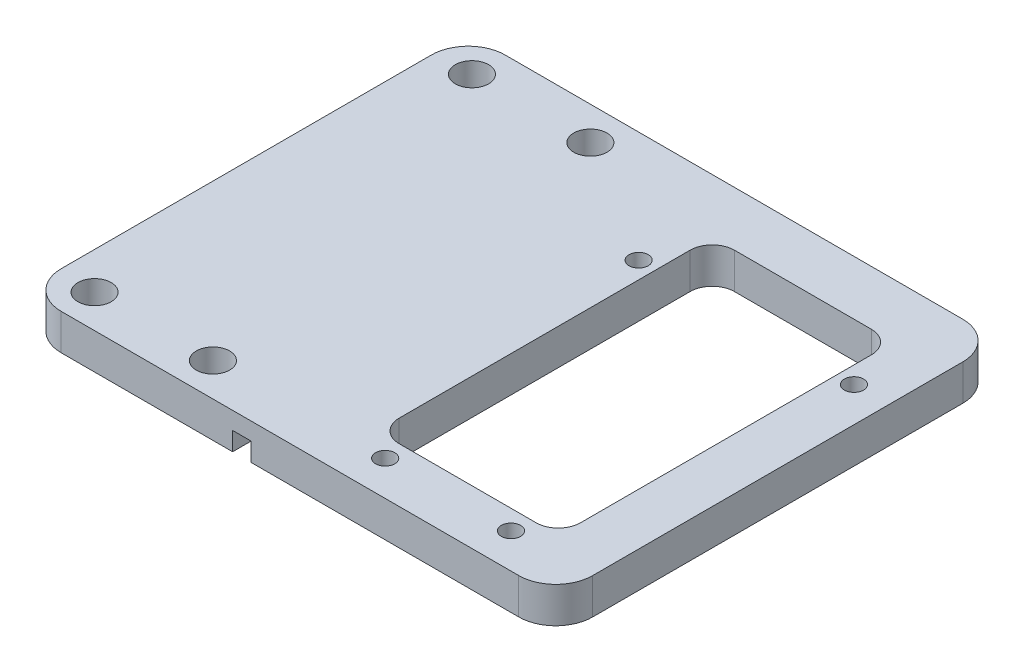
ISO-10303-21;
HEADER;
FILE_DESCRIPTION(('STEP AP214'),'2;1');
FILE_NAME('part.step','',(''),(''),'','','');
FILE_SCHEMA(('AUTOMOTIVE_DESIGN { 1 0 10303 214 1 1 1 1 }'));
ENDSEC;
DATA;
#1=APPLICATION_CONTEXT('core data for automotive mechanical design processes');
#2=APPLICATION_PROTOCOL_DEFINITION('international standard','automotive_design',2000,#1);
#3=PRODUCT_CONTEXT('',#1,'mechanical');
#4=PRODUCT('Part','Part','',(#3));
#5=PRODUCT_RELATED_PRODUCT_CATEGORY('part','',(#4));
#6=PRODUCT_DEFINITION_FORMATION('','',#4);
#7=PRODUCT_DEFINITION_CONTEXT('part definition',#1,'design');
#8=PRODUCT_DEFINITION('design','',#6,#7);
#9=PRODUCT_DEFINITION_SHAPE('','',#8);
#10=(LENGTH_UNIT() NAMED_UNIT(*) SI_UNIT(.MILLI.,.METRE.));
#11=(NAMED_UNIT(*) PLANE_ANGLE_UNIT() SI_UNIT($,.RADIAN.));
#12=(NAMED_UNIT(*) SI_UNIT($,.STERADIAN.) SOLID_ANGLE_UNIT());
#13=UNCERTAINTY_MEASURE_WITH_UNIT(LENGTH_MEASURE(1.E-05),#10,'distance_accuracy_value','');
#14=(GEOMETRIC_REPRESENTATION_CONTEXT(3) GLOBAL_UNCERTAINTY_ASSIGNED_CONTEXT((#13)) GLOBAL_UNIT_ASSIGNED_CONTEXT((#10,
#11,#12)) REPRESENTATION_CONTEXT('',''));
#15=CARTESIAN_POINT('',(0.,0.,0.));
#16=DIRECTION('',(0.,0.,1.));
#17=DIRECTION('',(1.,0.,0.));
#18=AXIS2_PLACEMENT_3D('',#15,#16,#17);
#19=CARTESIAN_POINT('',(-25.8215700728623,28.15,60.));
#20=DIRECTION('',(0.,1.,0.));
#21=DIRECTION('',(0.,0.,1.));
#22=AXIS2_PLACEMENT_3D('',#19,#20,#21);
#23=PLANE('',#22);
#24=CARTESIAN_POINT('',(-20.8215700728623,28.15,4.5));
#25=DIRECTION('',(0.,-1.,0.));
#26=DIRECTION('',(0.,0.,-1.));
#27=AXIS2_PLACEMENT_3D('',#24,#25,#26);
#28=CIRCLE('',#27,2.25);
#29=CARTESIAN_POINT('',(-20.8215700728623,28.15,2.25));
#30=VERTEX_POINT('',#29);
#31=EDGE_CURVE('E342',#30,#30,#28,.T.);
#32=ORIENTED_EDGE('',*,*,#31,.F.);
#33=EDGE_LOOP('',(#32));
#34=FACE_BOUND('',#33,.T.);
#35=CARTESIAN_POINT('',(-20.8215700728623,28.15,55.5));
#36=DIRECTION('',(0.,-1.,0.));
#37=DIRECTION('',(0.,0.,1.));
#38=AXIS2_PLACEMENT_3D('',#35,#36,#37);
#39=CIRCLE('',#38,2.25);
#40=CARTESIAN_POINT('',(-20.8215700728623,28.15,57.75));
#41=VERTEX_POINT('',#40);
#42=EDGE_CURVE('E337',#41,#41,#39,.T.);
#43=ORIENTED_EDGE('',*,*,#42,.F.);
#44=EDGE_LOOP('',(#43));
#45=FACE_BOUND('',#44,.T.);
#46=CARTESIAN_POINT('',(-4.82157007286232,28.15,55.5));
#47=DIRECTION('',(0.,-1.,0.));
#48=DIRECTION('',(0.,0.,-1.));
#49=AXIS2_PLACEMENT_3D('',#46,#47,#48);
#50=CIRCLE('',#49,2.25);
#51=CARTESIAN_POINT('',(-4.82157007286232,28.15,53.25));
#52=VERTEX_POINT('',#51);
#53=EDGE_CURVE('E331',#52,#52,#50,.T.);
#54=ORIENTED_EDGE('',*,*,#53,.F.);
#55=EDGE_LOOP('',(#54));
#56=FACE_BOUND('',#55,.T.);
#57=CARTESIAN_POINT('',(-4.82157007286231,28.15,4.5));
#58=DIRECTION('',(0.,-1.,0.));
#59=DIRECTION('',(0.,0.,1.));
#60=AXIS2_PLACEMENT_3D('',#57,#58,#59);
#61=CIRCLE('',#60,2.25);
#62=CARTESIAN_POINT('',(-4.82157007286231,28.15,6.75));
#63=VERTEX_POINT('',#62);
#64=EDGE_CURVE('E324',#63,#63,#61,.T.);
#65=ORIENTED_EDGE('',*,*,#64,.F.);
#66=EDGE_LOOP('',(#65));
#67=FACE_BOUND('',#66,.T.);
#68=DIRECTION('',(1.,0.,0.));
#69=VECTOR('',#68,1.);
#70=CARTESIAN_POINT('',(-25.8215700728623,28.15,0.));
#71=LINE('',#70,#69);
#72=CARTESIAN_POINT('',(-20.8215700728623,28.15,0.));
#73=VERTEX_POINT('',#72);
#74=CARTESIAN_POINT('',(2.33921496356885,28.15,0.));
#75=VERTEX_POINT('',#74);
#76=EDGE_CURVE('E351',#73,#75,#71,.T.);
#77=ORIENTED_EDGE('',*,*,#76,.T.);
#78=DIRECTION('',(0.,0.,-1.));
#79=VECTOR('',#78,1.);
#80=CARTESIAN_POINT('',(2.33921496356885,28.15,0.));
#81=LINE('',#80,#79);
#82=CARTESIAN_POINT('',(2.33921496356884,28.15,60.));
#83=VERTEX_POINT('',#82);
#84=EDGE_CURVE('E183',#83,#75,#81,.T.);
#85=ORIENTED_EDGE('',*,*,#84,.F.);
#86=DIRECTION('',(1.,0.,0.));
#87=VECTOR('',#86,1.);
#88=CARTESIAN_POINT('',(-25.8215700728623,28.15,60.));
#89=LINE('',#88,#87);
#90=CARTESIAN_POINT('',(-20.8215700728623,28.15,60.));
#91=VERTEX_POINT('',#90);
#92=EDGE_CURVE('E352',#91,#83,#89,.T.);
#93=ORIENTED_EDGE('',*,*,#92,.F.);
#94=CARTESIAN_POINT('',(-20.8215700728623,28.15,55.));
#95=DIRECTION('',(0.,1.,0.));
#96=DIRECTION('',(0.,0.,1.));
#97=AXIS2_PLACEMENT_3D('',#94,#95,#96);
#98=CIRCLE('',#97,5.);
#99=CARTESIAN_POINT('',(-25.8215700728623,28.15,55.));
#100=VERTEX_POINT('',#99);
#101=EDGE_CURVE('E375',#91,#100,#98,.F.);
#102=ORIENTED_EDGE('',*,*,#101,.T.);
#103=DIRECTION('',(0.,0.,-1.));
#104=VECTOR('',#103,1.);
#105=CARTESIAN_POINT('',(-25.8215700728623,28.15,60.));
#106=LINE('',#105,#104);
#107=CARTESIAN_POINT('',(-25.8215700728623,28.15,5.));
#108=VERTEX_POINT('',#107);
#109=EDGE_CURVE('E354',#100,#108,#106,.T.);
#110=ORIENTED_EDGE('',*,*,#109,.T.);
#111=CARTESIAN_POINT('',(-20.8215700728623,28.15,5.));
#112=DIRECTION('',(0.,1.,0.));
#113=DIRECTION('',(0.,0.,1.));
#114=AXIS2_PLACEMENT_3D('',#111,#112,#113);
#115=CIRCLE('',#114,5.);
#116=EDGE_CURVE('E49',#108,#73,#115,.F.);
#117=ORIENTED_EDGE('',*,*,#116,.T.);
#118=EDGE_LOOP('',(#77,#85,#93,#102,#110,#117));
#119=FACE_BOUND('',#118,.T.);
#120=ADVANCED_FACE('F41',(#34,#45,#56,#67,#119),#23,.F.);
#121=CARTESIAN_POINT('',(2.32842992713769,25.15,0.));
#122=DIRECTION('',(0.,0.,-1.));
#123=DIRECTION('',(0.,1.,0.));
#124=AXIS2_PLACEMENT_3D('',#121,#122,#123);
#125=PLANE('',#124);
#126=DIRECTION('',(0.,-1.,0.));
#127=VECTOR('',#126,1.);
#128=CARTESIAN_POINT('',(2.33921496356885,30.65,0.));
#129=LINE('',#128,#127);
#130=CARTESIAN_POINT('',(2.33921496356885,30.65,0.));
#131=VERTEX_POINT('',#130);
#132=EDGE_CURVE('E178',#131,#75,#129,.T.);
#133=ORIENTED_EDGE('',*,*,#132,.T.);
#134=ORIENTED_EDGE('',*,*,#76,.F.);
#135=DIRECTION('',(0.,1.,0.));
#136=VECTOR('',#135,1.);
#137=CARTESIAN_POINT('',(-20.8215700728623,25.15,0.));
#138=LINE('',#137,#136);
#139=CARTESIAN_POINT('',(-20.8215700728623,33.,0.));
#140=VERTEX_POINT('',#139);
#141=EDGE_CURVE('E363',#73,#140,#138,.T.);
#142=ORIENTED_EDGE('',*,*,#141,.T.);
#143=DIRECTION('',(1.,0.,0.));
#144=VECTOR('',#143,1.);
#145=CARTESIAN_POINT('',(-25.8215700728623,33.,0.));
#146=LINE('',#145,#144);
#147=CARTESIAN_POINT('',(41.,33.,0.));
#148=VERTEX_POINT('',#147);
#149=EDGE_CURVE('E345',#140,#148,#146,.T.);
#150=ORIENTED_EDGE('',*,*,#149,.T.);
#151=DIRECTION('',(0.,-1.,0.));
#152=VECTOR('',#151,1.);
#153=CARTESIAN_POINT('',(41.,28.15,0.));
#154=LINE('',#153,#152);
#155=CARTESIAN_POINT('',(41.,28.15,0.));
#156=VERTEX_POINT('',#155);
#157=EDGE_CURVE('E213',#148,#156,#154,.T.);
#158=ORIENTED_EDGE('',*,*,#157,.T.);
#159=CARTESIAN_POINT('',(4.83921496356885,28.15,0.));
#160=VERTEX_POINT('',#159);
#161=EDGE_CURVE('E356',#160,#156,#71,.T.);
#162=ORIENTED_EDGE('',*,*,#161,.F.);
#163=DIRECTION('',(0.,-1.,0.));
#164=VECTOR('',#163,1.);
#165=CARTESIAN_POINT('',(4.83921496356885,30.65,0.));
#166=LINE('',#165,#164);
#167=CARTESIAN_POINT('',(4.83921496356885,30.65,0.));
#168=VERTEX_POINT('',#167);
#169=EDGE_CURVE('E188',#168,#160,#166,.T.);
#170=ORIENTED_EDGE('',*,*,#169,.F.);
#171=DIRECTION('',(1.,0.,0.));
#172=VECTOR('',#171,1.);
#173=CARTESIAN_POINT('',(2.33921496356885,30.65,0.));
#174=LINE('',#173,#172);
#175=EDGE_CURVE('E192',#131,#168,#174,.T.);
#176=ORIENTED_EDGE('',*,*,#175,.F.);
#177=EDGE_LOOP('',(#133,#134,#142,#150,#158,#162,#170,#176));
#178=FACE_BOUND('',#177,.T.);
#179=ADVANCED_FACE('F198',(#178),#125,.T.);
#180=CARTESIAN_POINT('',(0.,33.,60.));
#181=DIRECTION('',(0.,1.,0.));
#182=DIRECTION('',(0.,0.,1.));
#183=AXIS2_PLACEMENT_3D('',#180,#181,#182);
#184=PLANE('',#183);
#185=CARTESIAN_POINT('',(-4.82157007286231,33.,4.5));
#186=DIRECTION('',(0.,1.,0.));
#187=DIRECTION('',(0.,0.,1.));
#188=AXIS2_PLACEMENT_3D('',#185,#186,#187);
#189=CIRCLE('',#188,2.25);
#190=CARTESIAN_POINT('',(-4.82157007286231,33.,6.75));
#191=VERTEX_POINT('',#190);
#192=EDGE_CURVE('E328',#191,#191,#189,.F.);
#193=ORIENTED_EDGE('',*,*,#192,.T.);
#194=EDGE_LOOP('',(#193));
#195=FACE_BOUND('',#194,.T.);
#196=CARTESIAN_POINT('',(-4.82157007286232,33.,55.5));
#197=DIRECTION('',(0.,1.,0.));
#198=DIRECTION('',(0.,0.,1.));
#199=AXIS2_PLACEMENT_3D('',#196,#197,#198);
#200=CIRCLE('',#199,2.25);
#201=CARTESIAN_POINT('',(-4.82157007286232,33.,57.75));
#202=VERTEX_POINT('',#201);
#203=EDGE_CURVE('E334',#202,#202,#200,.F.);
#204=ORIENTED_EDGE('',*,*,#203,.T.);
#205=EDGE_LOOP('',(#204));
#206=FACE_BOUND('',#205,.T.);
#207=CARTESIAN_POINT('',(-20.8215700728623,33.,55.5));
#208=DIRECTION('',(0.,1.,0.));
#209=DIRECTION('',(0.,0.,1.));
#210=AXIS2_PLACEMENT_3D('',#207,#208,#209);
#211=CIRCLE('',#210,2.25);
#212=CARTESIAN_POINT('',(-20.8215700728623,33.,57.75));
#213=VERTEX_POINT('',#212);
#214=EDGE_CURVE('E216',#213,#213,#211,.F.);
#215=ORIENTED_EDGE('',*,*,#214,.T.);
#216=EDGE_LOOP('',(#215));
#217=FACE_BOUND('',#216,.T.);
#218=CARTESIAN_POINT('',(-20.8215700728623,33.,4.5));
#219=DIRECTION('',(0.,1.,0.));
#220=DIRECTION('',(0.,0.,1.));
#221=AXIS2_PLACEMENT_3D('',#218,#219,#220);
#222=CIRCLE('',#221,2.25);
#223=CARTESIAN_POINT('',(-20.8215700728623,33.,6.75));
#224=VERTEX_POINT('',#223);
#225=EDGE_CURVE('E327',#224,#224,#222,.F.);
#226=ORIENTED_EDGE('',*,*,#225,.T.);
#227=EDGE_LOOP('',(#226));
#228=FACE_BOUND('',#227,.T.);
#229=ORIENTED_EDGE('',*,*,#149,.F.);
#230=CARTESIAN_POINT('',(-20.8215700728623,33.,5.));
#231=DIRECTION('',(0.,1.,0.));
#232=DIRECTION('',(0.,0.,1.));
#233=AXIS2_PLACEMENT_3D('',#230,#231,#232);
#234=CIRCLE('',#233,5.);
#235=CARTESIAN_POINT('',(-25.8215700728623,33.,5.));
#236=VERTEX_POINT('',#235);
#237=EDGE_CURVE('E368',#140,#236,#234,.T.);
#238=ORIENTED_EDGE('',*,*,#237,.T.);
#239=DIRECTION('',(0.,0.,-1.));
#240=VECTOR('',#239,1.);
#241=CARTESIAN_POINT('',(-25.8215700728623,33.,60.));
#242=LINE('',#241,#240);
#243=CARTESIAN_POINT('',(-25.8215700728623,33.,55.));
#244=VERTEX_POINT('',#243);
#245=EDGE_CURVE('E360',#244,#236,#242,.T.);
#246=ORIENTED_EDGE('',*,*,#245,.F.);
#247=CARTESIAN_POINT('',(-20.8215700728623,33.,55.));
#248=DIRECTION('',(0.,1.,0.));
#249=DIRECTION('',(0.,0.,1.));
#250=AXIS2_PLACEMENT_3D('',#247,#248,#249);
#251=CIRCLE('',#250,5.);
#252=CARTESIAN_POINT('',(-20.8215700728623,33.,60.));
#253=VERTEX_POINT('',#252);
#254=EDGE_CURVE('E366',#244,#253,#251,.T.);
#255=ORIENTED_EDGE('',*,*,#254,.T.);
#256=DIRECTION('',(1.,0.,0.));
#257=VECTOR('',#256,1.);
#258=CARTESIAN_POINT('',(-25.8215700728623,33.,60.));
#259=LINE('',#258,#257);
#260=CARTESIAN_POINT('',(41.,33.,60.));
#261=VERTEX_POINT('',#260);
#262=EDGE_CURVE('E348',#253,#261,#259,.T.);
#263=ORIENTED_EDGE('',*,*,#262,.T.);
#264=CARTESIAN_POINT('',(41.,33.,55.));
#265=DIRECTION('',(0.,1.,0.));
#266=DIRECTION('',(0.,0.,1.));
#267=AXIS2_PLACEMENT_3D('',#264,#265,#266);
#268=CIRCLE('',#267,5.);
#269=CARTESIAN_POINT('',(46.,33.,55.));
#270=VERTEX_POINT('',#269);
#271=EDGE_CURVE('E233',#261,#270,#268,.T.);
#272=ORIENTED_EDGE('',*,*,#271,.T.);
#273=DIRECTION('',(0.,0.,-1.));
#274=VECTOR('',#273,1.);
#275=CARTESIAN_POINT('',(46.,33.,60.));
#276=LINE('',#275,#274);
#277=CARTESIAN_POINT('',(46.,33.,5.));
#278=VERTEX_POINT('',#277);
#279=EDGE_CURVE('E238',#270,#278,#276,.T.);
#280=ORIENTED_EDGE('',*,*,#279,.T.);
#281=CARTESIAN_POINT('',(41.,33.,5.));
#282=DIRECTION('',(0.,1.,0.));
#283=DIRECTION('',(0.,0.,1.));
#284=AXIS2_PLACEMENT_3D('',#281,#282,#283);
#285=CIRCLE('',#284,5.);
#286=EDGE_CURVE('E235',#278,#148,#285,.T.);
#287=ORIENTED_EDGE('',*,*,#286,.T.);
#288=EDGE_LOOP('',(#229,#238,#246,#255,#263,#272,#280,#287));
#289=FACE_BOUND('',#288,.T.);
#290=CARTESIAN_POINT('',(35.25,33.,55.3));
#291=DIRECTION('',(0.,1.,0.));
#292=DIRECTION('',(0.,0.,-1.));
#293=AXIS2_PLACEMENT_3D('',#290,#291,#292);
#294=CIRCLE('',#293,1.3);
#295=CARTESIAN_POINT('',(35.25,33.,54.));
#296=VERTEX_POINT('',#295);
#297=EDGE_CURVE('E252',#296,#296,#294,.T.);
#298=ORIENTED_EDGE('',*,*,#297,.F.);
#299=EDGE_LOOP('',(#298));
#300=FACE_BOUND('',#299,.T.);
#301=CARTESIAN_POINT('',(41.3,33.,15.));
#302=DIRECTION('',(0.,1.,0.));
#303=DIRECTION('',(0.,0.,1.));
#304=AXIS2_PLACEMENT_3D('',#301,#302,#303);
#305=CIRCLE('',#304,1.3);
#306=CARTESIAN_POINT('',(41.3,33.,16.3));
#307=VERTEX_POINT('',#306);
#308=EDGE_CURVE('E258',#307,#307,#305,.T.);
#309=ORIENTED_EDGE('',*,*,#308,.F.);
#310=EDGE_LOOP('',(#309));
#311=FACE_BOUND('',#310,.T.);
#312=CARTESIAN_POINT('',(12.2,33.,15.));
#313=DIRECTION('',(0.,1.,0.));
#314=DIRECTION('',(0.,0.,-1.));
#315=AXIS2_PLACEMENT_3D('',#312,#313,#314);
#316=CIRCLE('',#315,1.3);
#317=CARTESIAN_POINT('',(12.2,33.,13.7));
#318=VERTEX_POINT('',#317);
#319=EDGE_CURVE('E264',#318,#318,#316,.T.);
#320=ORIENTED_EDGE('',*,*,#319,.F.);
#321=EDGE_LOOP('',(#320));
#322=FACE_BOUND('',#321,.T.);
#323=CARTESIAN_POINT('',(18.25,33.,55.3));
#324=DIRECTION('',(0.,1.,0.));
#325=DIRECTION('',(0.,0.,1.));
#326=AXIS2_PLACEMENT_3D('',#323,#324,#325);
#327=CIRCLE('',#326,1.3);
#328=CARTESIAN_POINT('',(18.25,33.,56.6));
#329=VERTEX_POINT('',#328);
#330=EDGE_CURVE('E270',#329,#329,#327,.T.);
#331=ORIENTED_EDGE('',*,*,#330,.F.);
#332=EDGE_LOOP('',(#331));
#333=FACE_BOUND('',#332,.T.);
#334=DIRECTION('',(0.,0.,1.));
#335=VECTOR('',#334,1.);
#336=CARTESIAN_POINT('',(14.5,33.,52.65));
#337=LINE('',#336,#335);
#338=CARTESIAN_POINT('',(14.5,33.,10.35));
#339=VERTEX_POINT('',#338);
#340=CARTESIAN_POINT('',(14.5,33.,49.65));
#341=VERTEX_POINT('',#340);
#342=EDGE_CURVE('E281',#339,#341,#337,.T.);
#343=ORIENTED_EDGE('',*,*,#342,.F.);
#344=CARTESIAN_POINT('',(17.5,33.,10.35));
#345=DIRECTION('',(0.,1.,0.));
#346=DIRECTION('',(0.,0.,1.));
#347=AXIS2_PLACEMENT_3D('',#344,#345,#346);
#348=CIRCLE('',#347,3.);
#349=CARTESIAN_POINT('',(17.5,33.,7.35));
#350=VERTEX_POINT('',#349);
#351=EDGE_CURVE('E247',#339,#350,#348,.F.);
#352=ORIENTED_EDGE('',*,*,#351,.T.);
#353=DIRECTION('',(-1.,0.,0.));
#354=VECTOR('',#353,1.);
#355=CARTESIAN_POINT('',(14.5,33.,7.35));
#356=LINE('',#355,#354);
#357=CARTESIAN_POINT('',(36.,33.,7.35));
#358=VERTEX_POINT('',#357);
#359=EDGE_CURVE('E286',#358,#350,#356,.T.);
#360=ORIENTED_EDGE('',*,*,#359,.F.);
#361=CARTESIAN_POINT('',(36.,33.,10.35));
#362=DIRECTION('',(0.,1.,0.));
#363=DIRECTION('',(0.,0.,1.));
#364=AXIS2_PLACEMENT_3D('',#361,#362,#363);
#365=CIRCLE('',#364,3.);
#366=CARTESIAN_POINT('',(39.,33.,10.35));
#367=VERTEX_POINT('',#366);
#368=EDGE_CURVE('E245',#358,#367,#365,.F.);
#369=ORIENTED_EDGE('',*,*,#368,.T.);
#370=DIRECTION('',(0.,0.,-1.));
#371=VECTOR('',#370,1.);
#372=CARTESIAN_POINT('',(39.,33.,52.65));
#373=LINE('',#372,#371);
#374=CARTESIAN_POINT('',(39.,33.,49.65));
#375=VERTEX_POINT('',#374);
#376=EDGE_CURVE('E297',#375,#367,#373,.T.);
#377=ORIENTED_EDGE('',*,*,#376,.F.);
#378=CARTESIAN_POINT('',(36.,33.,49.65));
#379=DIRECTION('',(0.,1.,0.));
#380=DIRECTION('',(0.,0.,1.));
#381=AXIS2_PLACEMENT_3D('',#378,#379,#380);
#382=CIRCLE('',#381,3.);
#383=CARTESIAN_POINT('',(36.,33.,52.65));
#384=VERTEX_POINT('',#383);
#385=EDGE_CURVE('E243',#375,#384,#382,.F.);
#386=ORIENTED_EDGE('',*,*,#385,.T.);
#387=DIRECTION('',(1.,0.,0.));
#388=VECTOR('',#387,1.);
#389=CARTESIAN_POINT('',(14.5,33.,52.65));
#390=LINE('',#389,#388);
#391=CARTESIAN_POINT('',(17.5,33.,52.65));
#392=VERTEX_POINT('',#391);
#393=EDGE_CURVE('E308',#392,#384,#390,.T.);
#394=ORIENTED_EDGE('',*,*,#393,.F.);
#395=CARTESIAN_POINT('',(17.5,33.,49.65));
#396=DIRECTION('',(0.,1.,0.));
#397=DIRECTION('',(0.,0.,1.));
#398=AXIS2_PLACEMENT_3D('',#395,#396,#397);
#399=CIRCLE('',#398,3.);
#400=EDGE_CURVE('E241',#392,#341,#399,.F.);
#401=ORIENTED_EDGE('',*,*,#400,.T.);
#402=EDGE_LOOP('',(#343,#352,#360,#369,#377,#386,#394,#401));
#403=FACE_BOUND('',#402,.T.);
#404=ADVANCED_FACE('F43',(#195,#206,#217,#228,#289,#300,#311,#322,#333,#403),#184,.T.);
#405=CARTESIAN_POINT('',(-25.8215700728623,28.15,60.));
#406=DIRECTION('',(-1.,0.,0.));
#407=DIRECTION('',(0.,0.,-1.));
#408=AXIS2_PLACEMENT_3D('',#405,#406,#407);
#409=PLANE('',#408);
#410=ORIENTED_EDGE('',*,*,#245,.T.);
#411=DIRECTION('',(0.,1.,0.));
#412=VECTOR('',#411,1.);
#413=CARTESIAN_POINT('',(-25.8215700728623,28.15,5.));
#414=LINE('',#413,#412);
#415=EDGE_CURVE('E373',#236,#108,#414,.F.);
#416=ORIENTED_EDGE('',*,*,#415,.T.);
#417=ORIENTED_EDGE('',*,*,#109,.F.);
#418=DIRECTION('',(0.,1.,0.));
#419=VECTOR('',#418,1.);
#420=CARTESIAN_POINT('',(-25.8215700728623,28.15,55.));
#421=LINE('',#420,#419);
#422=EDGE_CURVE('E370',#100,#244,#421,.T.);
#423=ORIENTED_EDGE('',*,*,#422,.T.);
#424=EDGE_LOOP('',(#410,#416,#417,#423));
#425=FACE_BOUND('',#424,.T.);
#426=ADVANCED_FACE('F388',(#425),#409,.T.);
#427=CARTESIAN_POINT('',(4.83921496356885,28.15,60.));
#428=VERTEX_POINT('',#427);
#429=CARTESIAN_POINT('',(41.,28.15,60.));
#430=VERTEX_POINT('',#429);
#431=EDGE_CURVE('E350',#428,#430,#89,.T.);
#432=ORIENTED_EDGE('',*,*,#431,.F.);
#433=DIRECTION('',(0.,0.,1.));
#434=VECTOR('',#433,1.);
#435=CARTESIAN_POINT('',(4.83921496356885,28.15,0.));
#436=LINE('',#435,#434);
#437=EDGE_CURVE('E196',#160,#428,#436,.T.);
#438=ORIENTED_EDGE('',*,*,#437,.F.);
#439=ORIENTED_EDGE('',*,*,#161,.T.);
#440=CARTESIAN_POINT('',(41.,28.15,5.));
#441=DIRECTION('',(0.,1.,0.));
#442=DIRECTION('',(0.,0.,1.));
#443=AXIS2_PLACEMENT_3D('',#440,#441,#442);
#444=CIRCLE('',#443,5.);
#445=CARTESIAN_POINT('',(46.,28.15,5.));
#446=VERTEX_POINT('',#445);
#447=EDGE_CURVE('E220',#156,#446,#444,.F.);
#448=ORIENTED_EDGE('',*,*,#447,.T.);
#449=DIRECTION('',(0.,0.,-1.));
#450=VECTOR('',#449,1.);
#451=CARTESIAN_POINT('',(46.,28.15,60.));
#452=LINE('',#451,#450);
#453=CARTESIAN_POINT('',(46.,28.15,55.));
#454=VERTEX_POINT('',#453);
#455=EDGE_CURVE('E208',#454,#446,#452,.T.);
#456=ORIENTED_EDGE('',*,*,#455,.F.);
#457=CARTESIAN_POINT('',(41.,28.15,55.));
#458=DIRECTION('',(0.,1.,0.));
#459=DIRECTION('',(0.,0.,1.));
#460=AXIS2_PLACEMENT_3D('',#457,#458,#459);
#461=CIRCLE('',#460,5.);
#462=EDGE_CURVE('E217',#454,#430,#461,.F.);
#463=ORIENTED_EDGE('',*,*,#462,.T.);
#464=EDGE_LOOP('',(#432,#438,#439,#448,#456,#463));
#465=FACE_BOUND('',#464,.T.);
#466=CARTESIAN_POINT('',(35.25,28.15,55.3));
#467=DIRECTION('',(0.,1.,0.));
#468=DIRECTION('',(0.,0.,1.));
#469=AXIS2_PLACEMENT_3D('',#466,#467,#468);
#470=CIRCLE('',#469,1.3);
#471=CARTESIAN_POINT('',(35.25,28.15,56.6));
#472=VERTEX_POINT('',#471);
#473=EDGE_CURVE('E249',#472,#472,#470,.F.);
#474=ORIENTED_EDGE('',*,*,#473,.F.);
#475=EDGE_LOOP('',(#474));
#476=FACE_BOUND('',#475,.T.);
#477=CARTESIAN_POINT('',(41.3,28.15,15.));
#478=DIRECTION('',(0.,1.,0.));
#479=DIRECTION('',(0.,0.,1.));
#480=AXIS2_PLACEMENT_3D('',#477,#478,#479);
#481=CIRCLE('',#480,1.3);
#482=CARTESIAN_POINT('',(41.3,28.15,16.3));
#483=VERTEX_POINT('',#482);
#484=EDGE_CURVE('E255',#483,#483,#481,.F.);
#485=ORIENTED_EDGE('',*,*,#484,.F.);
#486=EDGE_LOOP('',(#485));
#487=FACE_BOUND('',#486,.T.);
#488=CARTESIAN_POINT('',(12.2,28.15,15.));
#489=DIRECTION('',(0.,1.,0.));
#490=DIRECTION('',(0.,0.,1.));
#491=AXIS2_PLACEMENT_3D('',#488,#489,#490);
#492=CIRCLE('',#491,1.3);
#493=CARTESIAN_POINT('',(12.2,28.15,16.3));
#494=VERTEX_POINT('',#493);
#495=EDGE_CURVE('E261',#494,#494,#492,.F.);
#496=ORIENTED_EDGE('',*,*,#495,.F.);
#497=EDGE_LOOP('',(#496));
#498=FACE_BOUND('',#497,.T.);
#499=CARTESIAN_POINT('',(18.25,28.15,55.3));
#500=DIRECTION('',(0.,1.,0.));
#501=DIRECTION('',(0.,0.,1.));
#502=AXIS2_PLACEMENT_3D('',#499,#500,#501);
#503=CIRCLE('',#502,1.3);
#504=CARTESIAN_POINT('',(18.25,28.15,56.6));
#505=VERTEX_POINT('',#504);
#506=EDGE_CURVE('E267',#505,#505,#503,.F.);
#507=ORIENTED_EDGE('',*,*,#506,.F.);
#508=EDGE_LOOP('',(#507));
#509=FACE_BOUND('',#508,.T.);
#510=DIRECTION('',(1.,0.,0.));
#511=VECTOR('',#510,1.);
#512=CARTESIAN_POINT('',(14.5,28.15,7.35));
#513=LINE('',#512,#511);
#514=CARTESIAN_POINT('',(17.5,28.15,7.35));
#515=VERTEX_POINT('',#514);
#516=CARTESIAN_POINT('',(36.,28.15,7.35));
#517=VERTEX_POINT('',#516);
#518=EDGE_CURVE('E292',#515,#517,#513,.T.);
#519=ORIENTED_EDGE('',*,*,#518,.F.);
#520=CARTESIAN_POINT('',(17.5,28.15,10.35));
#521=DIRECTION('',(0.,1.,0.));
#522=DIRECTION('',(0.,0.,1.));
#523=AXIS2_PLACEMENT_3D('',#520,#521,#522);
#524=CIRCLE('',#523,3.);
#525=CARTESIAN_POINT('',(14.5,28.15,10.35));
#526=VERTEX_POINT('',#525);
#527=EDGE_CURVE('E228',#515,#526,#524,.T.);
#528=ORIENTED_EDGE('',*,*,#527,.T.);
#529=DIRECTION('',(0.,0.,-1.));
#530=VECTOR('',#529,1.);
#531=CARTESIAN_POINT('',(14.5,28.15,52.65));
#532=LINE('',#531,#530);
#533=CARTESIAN_POINT('',(14.5,28.15,49.65));
#534=VERTEX_POINT('',#533);
#535=EDGE_CURVE('E276',#534,#526,#532,.T.);
#536=ORIENTED_EDGE('',*,*,#535,.F.);
#537=CARTESIAN_POINT('',(17.5,28.15,49.65));
#538=DIRECTION('',(0.,1.,0.));
#539=DIRECTION('',(0.,0.,1.));
#540=AXIS2_PLACEMENT_3D('',#537,#538,#539);
#541=CIRCLE('',#540,3.);
#542=CARTESIAN_POINT('',(17.5,28.15,52.65));
#543=VERTEX_POINT('',#542);
#544=EDGE_CURVE('E226',#534,#543,#541,.T.);
#545=ORIENTED_EDGE('',*,*,#544,.T.);
#546=DIRECTION('',(-1.,0.,0.));
#547=VECTOR('',#546,1.);
#548=CARTESIAN_POINT('',(14.5,28.15,52.65));
#549=LINE('',#548,#547);
#550=CARTESIAN_POINT('',(36.,28.15,52.65));
#551=VERTEX_POINT('',#550);
#552=EDGE_CURVE('E314',#551,#543,#549,.T.);
#553=ORIENTED_EDGE('',*,*,#552,.F.);
#554=CARTESIAN_POINT('',(36.,28.15,49.65));
#555=DIRECTION('',(0.,1.,0.));
#556=DIRECTION('',(0.,0.,1.));
#557=AXIS2_PLACEMENT_3D('',#554,#555,#556);
#558=CIRCLE('',#557,3.);
#559=CARTESIAN_POINT('',(39.,28.15,49.65));
#560=VERTEX_POINT('',#559);
#561=EDGE_CURVE('E224',#551,#560,#558,.T.);
#562=ORIENTED_EDGE('',*,*,#561,.T.);
#563=DIRECTION('',(0.,0.,1.));
#564=VECTOR('',#563,1.);
#565=CARTESIAN_POINT('',(39.,28.15,52.65));
#566=LINE('',#565,#564);
#567=CARTESIAN_POINT('',(39.,28.15,10.35));
#568=VERTEX_POINT('',#567);
#569=EDGE_CURVE('E303',#568,#560,#566,.T.);
#570=ORIENTED_EDGE('',*,*,#569,.F.);
#571=CARTESIAN_POINT('',(36.,28.15,10.35));
#572=DIRECTION('',(0.,1.,0.));
#573=DIRECTION('',(0.,0.,1.));
#574=AXIS2_PLACEMENT_3D('',#571,#572,#573);
#575=CIRCLE('',#574,3.);
#576=EDGE_CURVE('E222',#568,#517,#575,.T.);
#577=ORIENTED_EDGE('',*,*,#576,.T.);
#578=EDGE_LOOP('',(#519,#528,#536,#545,#553,#562,#570,#577));
#579=FACE_BOUND('',#578,.T.);
#580=ADVANCED_FACE('F412',(#465,#476,#487,#498,#509,#579),#23,.F.);
#581=CARTESIAN_POINT('',(-0.671570072862313,25.15,60.));
#582=DIRECTION('',(0.,0.,1.));
#583=DIRECTION('',(0.,-1.,0.));
#584=AXIS2_PLACEMENT_3D('',#581,#582,#583);
#585=PLANE('',#584);
#586=DIRECTION('',(0.,-1.,0.));
#587=VECTOR('',#586,1.);
#588=CARTESIAN_POINT('',(2.33921496356884,30.65,60.));
#589=LINE('',#588,#587);
#590=CARTESIAN_POINT('',(2.33921496356884,30.65,60.));
#591=VERTEX_POINT('',#590);
#592=EDGE_CURVE('E206',#591,#83,#589,.T.);
#593=ORIENTED_EDGE('',*,*,#592,.F.);
#594=DIRECTION('',(-1.,0.,0.));
#595=VECTOR('',#594,1.);
#596=CARTESIAN_POINT('',(2.33921496356884,30.65,60.));
#597=LINE('',#596,#595);
#598=CARTESIAN_POINT('',(4.83921496356885,30.65,60.));
#599=VERTEX_POINT('',#598);
#600=EDGE_CURVE('E189',#599,#591,#597,.T.);
#601=ORIENTED_EDGE('',*,*,#600,.F.);
#602=DIRECTION('',(0.,-1.,0.));
#603=VECTOR('',#602,1.);
#604=CARTESIAN_POINT('',(4.83921496356885,30.65,60.));
#605=LINE('',#604,#603);
#606=EDGE_CURVE('E209',#599,#428,#605,.T.);
#607=ORIENTED_EDGE('',*,*,#606,.T.);
#608=ORIENTED_EDGE('',*,*,#431,.T.);
#609=DIRECTION('',(0.,-1.,0.));
#610=VECTOR('',#609,1.);
#611=CARTESIAN_POINT('',(41.,25.15,60.));
#612=LINE('',#611,#610);
#613=EDGE_CURVE('E230',#430,#261,#612,.F.);
#614=ORIENTED_EDGE('',*,*,#613,.T.);
#615=ORIENTED_EDGE('',*,*,#262,.F.);
#616=DIRECTION('',(0.,1.,0.));
#617=VECTOR('',#616,1.);
#618=CARTESIAN_POINT('',(-20.8215700728623,25.15,60.));
#619=LINE('',#618,#617);
#620=EDGE_CURVE('E12',#253,#91,#619,.F.);
#621=ORIENTED_EDGE('',*,*,#620,.T.);
#622=ORIENTED_EDGE('',*,*,#92,.T.);
#623=EDGE_LOOP('',(#593,#601,#607,#608,#614,#615,#621,#622));
#624=FACE_BOUND('',#623,.T.);
#625=ADVANCED_FACE('F393',(#624),#585,.T.);
#626=CARTESIAN_POINT('',(-20.8215700728623,33.001,4.5));
#627=DIRECTION('',(0.,-1.,0.));
#628=DIRECTION('',(0.,0.,-1.));
#629=AXIS2_PLACEMENT_3D('',#626,#627,#628);
#630=CYLINDRICAL_SURFACE('',#629,2.25);
#631=ORIENTED_EDGE('',*,*,#225,.F.);
#632=EDGE_LOOP('',(#631));
#633=FACE_BOUND('',#632,.T.);
#634=ORIENTED_EDGE('',*,*,#31,.T.);
#635=EDGE_LOOP('',(#634));
#636=FACE_BOUND('',#635,.T.);
#637=ADVANCED_FACE('F441',(#633,#636),#630,.F.);
#638=CARTESIAN_POINT('',(-20.8215700728623,33.001,55.5));
#639=DIRECTION('',(0.,-1.,0.));
#640=DIRECTION('',(0.,0.,-1.));
#641=AXIS2_PLACEMENT_3D('',#638,#639,#640);
#642=CYLINDRICAL_SURFACE('',#641,2.25);
#643=ORIENTED_EDGE('',*,*,#214,.F.);
#644=EDGE_LOOP('',(#643));
#645=FACE_BOUND('',#644,.T.);
#646=ORIENTED_EDGE('',*,*,#42,.T.);
#647=EDGE_LOOP('',(#646));
#648=FACE_BOUND('',#647,.T.);
#649=ADVANCED_FACE('F514',(#645,#648),#642,.F.);
#650=CARTESIAN_POINT('',(-4.82157007286232,33.001,55.5));
#651=DIRECTION('',(0.,-1.,0.));
#652=DIRECTION('',(0.,0.,-1.));
#653=AXIS2_PLACEMENT_3D('',#650,#651,#652);
#654=CYLINDRICAL_SURFACE('',#653,2.25);
#655=ORIENTED_EDGE('',*,*,#203,.F.);
#656=EDGE_LOOP('',(#655));
#657=FACE_BOUND('',#656,.T.);
#658=ORIENTED_EDGE('',*,*,#53,.T.);
#659=EDGE_LOOP('',(#658));
#660=FACE_BOUND('',#659,.T.);
#661=ADVANCED_FACE('F510',(#657,#660),#654,.F.);
#662=CARTESIAN_POINT('',(-4.82157007286231,33.001,4.5));
#663=DIRECTION('',(0.,-1.,0.));
#664=DIRECTION('',(0.,0.,-1.));
#665=AXIS2_PLACEMENT_3D('',#662,#663,#664);
#666=CYLINDRICAL_SURFACE('',#665,2.25);
#667=ORIENTED_EDGE('',*,*,#192,.F.);
#668=EDGE_LOOP('',(#667));
#669=FACE_BOUND('',#668,.T.);
#670=ORIENTED_EDGE('',*,*,#64,.T.);
#671=EDGE_LOOP('',(#670));
#672=FACE_BOUND('',#671,.T.);
#673=ADVANCED_FACE('F448',(#669,#672),#666,.F.);
#674=CARTESIAN_POINT('',(-20.8215700728623,25.15,5.));
#675=DIRECTION('',(0.,1.,0.));
#676=DIRECTION('',(0.,0.,1.));
#677=AXIS2_PLACEMENT_3D('',#674,#675,#676);
#678=CYLINDRICAL_SURFACE('',#677,5.);
#679=ORIENTED_EDGE('',*,*,#116,.F.);
#680=ORIENTED_EDGE('',*,*,#415,.F.);
#681=ORIENTED_EDGE('',*,*,#237,.F.);
#682=ORIENTED_EDGE('',*,*,#141,.F.);
#683=EDGE_LOOP('',(#679,#680,#681,#682));
#684=FACE_BOUND('',#683,.T.);
#685=ADVANCED_FACE('F383',(#684),#678,.T.);
#686=CARTESIAN_POINT('',(-20.8215700728623,28.15,55.));
#687=DIRECTION('',(0.,1.,0.));
#688=DIRECTION('',(0.,0.,1.));
#689=AXIS2_PLACEMENT_3D('',#686,#687,#688);
#690=CYLINDRICAL_SURFACE('',#689,5.);
#691=ORIENTED_EDGE('',*,*,#101,.F.);
#692=ORIENTED_EDGE('',*,*,#620,.F.);
#693=ORIENTED_EDGE('',*,*,#254,.F.);
#694=ORIENTED_EDGE('',*,*,#422,.F.);
#695=EDGE_LOOP('',(#691,#692,#693,#694));
#696=FACE_BOUND('',#695,.T.);
#697=ADVANCED_FACE('F392',(#696),#690,.T.);
#698=CARTESIAN_POINT('',(41.,33.,55.));
#699=DIRECTION('',(0.,-1.,0.));
#700=DIRECTION('',(0.,0.,-1.));
#701=AXIS2_PLACEMENT_3D('',#698,#699,#700);
#702=CYLINDRICAL_SURFACE('',#701,5.);
#703=ORIENTED_EDGE('',*,*,#271,.F.);
#704=ORIENTED_EDGE('',*,*,#613,.F.);
#705=ORIENTED_EDGE('',*,*,#462,.F.);
#706=DIRECTION('',(0.,-1.,0.));
#707=VECTOR('',#706,1.);
#708=CARTESIAN_POINT('',(46.,33.,55.));
#709=LINE('',#708,#707);
#710=EDGE_CURVE('E317',#270,#454,#709,.T.);
#711=ORIENTED_EDGE('',*,*,#710,.F.);
#712=EDGE_LOOP('',(#703,#704,#705,#711));
#713=FACE_BOUND('',#712,.T.);
#714=ADVANCED_FACE('F399',(#713),#702,.T.);
#715=CARTESIAN_POINT('',(41.,25.15,5.));
#716=DIRECTION('',(0.,1.,0.));
#717=DIRECTION('',(0.,0.,1.));
#718=AXIS2_PLACEMENT_3D('',#715,#716,#717);
#719=CYLINDRICAL_SURFACE('',#718,5.);
#720=ORIENTED_EDGE('',*,*,#286,.F.);
#721=DIRECTION('',(0.,-1.,0.));
#722=VECTOR('',#721,1.);
#723=CARTESIAN_POINT('',(46.,33.,5.));
#724=LINE('',#723,#722);
#725=EDGE_CURVE('E320',#446,#278,#724,.F.);
#726=ORIENTED_EDGE('',*,*,#725,.F.);
#727=ORIENTED_EDGE('',*,*,#447,.F.);
#728=ORIENTED_EDGE('',*,*,#157,.F.);
#729=EDGE_LOOP('',(#720,#726,#727,#728));
#730=FACE_BOUND('',#729,.T.);
#731=ADVANCED_FACE('F408',(#730),#719,.T.);
#732=CARTESIAN_POINT('',(46.,33.,60.));
#733=DIRECTION('',(1.,0.,0.));
#734=DIRECTION('',(0.,0.,-1.));
#735=AXIS2_PLACEMENT_3D('',#732,#733,#734);
#736=PLANE('',#735);
#737=ORIENTED_EDGE('',*,*,#455,.T.);
#738=ORIENTED_EDGE('',*,*,#725,.T.);
#739=ORIENTED_EDGE('',*,*,#279,.F.);
#740=ORIENTED_EDGE('',*,*,#710,.T.);
#741=EDGE_LOOP('',(#737,#738,#739,#740));
#742=FACE_BOUND('',#741,.T.);
#743=ADVANCED_FACE('F403',(#742),#736,.T.);
#744=CARTESIAN_POINT('',(17.5,-0.001000000000001,49.65));
#745=DIRECTION('',(0.,-1.,0.));
#746=DIRECTION('',(0.,0.,-1.));
#747=AXIS2_PLACEMENT_3D('',#744,#745,#746);
#748=CYLINDRICAL_SURFACE('',#747,3.);
#749=ORIENTED_EDGE('',*,*,#544,.F.);
#750=DIRECTION('',(0.,1.,0.));
#751=VECTOR('',#750,1.);
#752=CARTESIAN_POINT('',(14.5,28.15,49.65));
#753=LINE('',#752,#751);
#754=EDGE_CURVE('E279',#341,#534,#753,.F.);
#755=ORIENTED_EDGE('',*,*,#754,.F.);
#756=ORIENTED_EDGE('',*,*,#400,.F.);
#757=DIRECTION('',(0.,1.,0.));
#758=VECTOR('',#757,1.);
#759=CARTESIAN_POINT('',(17.5,33.,52.65));
#760=LINE('',#759,#758);
#761=EDGE_CURVE('E311',#543,#392,#760,.T.);
#762=ORIENTED_EDGE('',*,*,#761,.F.);
#763=EDGE_LOOP('',(#749,#755,#756,#762));
#764=FACE_BOUND('',#763,.T.);
#765=ADVANCED_FACE('F461',(#764),#748,.F.);
#766=CARTESIAN_POINT('',(14.5,-0.001000000000001,52.65));
#767=DIRECTION('',(0.,0.,1.));
#768=DIRECTION('',(1.,0.,0.));
#769=AXIS2_PLACEMENT_3D('',#766,#767,#768);
#770=PLANE('',#769);
#771=ORIENTED_EDGE('',*,*,#552,.T.);
#772=ORIENTED_EDGE('',*,*,#761,.T.);
#773=ORIENTED_EDGE('',*,*,#393,.T.);
#774=DIRECTION('',(0.,1.,0.));
#775=VECTOR('',#774,1.);
#776=CARTESIAN_POINT('',(36.,28.15,52.65));
#777=LINE('',#776,#775);
#778=EDGE_CURVE('E306',#384,#551,#777,.F.);
#779=ORIENTED_EDGE('',*,*,#778,.T.);
#780=EDGE_LOOP('',(#771,#772,#773,#779));
#781=FACE_BOUND('',#780,.T.);
#782=ADVANCED_FACE('F464',(#781),#770,.F.);
#783=CARTESIAN_POINT('',(36.,-0.001000000000001,49.65));
#784=DIRECTION('',(0.,-1.,0.));
#785=DIRECTION('',(0.,0.,-1.));
#786=AXIS2_PLACEMENT_3D('',#783,#784,#785);
#787=CYLINDRICAL_SURFACE('',#786,3.);
#788=ORIENTED_EDGE('',*,*,#561,.F.);
#789=ORIENTED_EDGE('',*,*,#778,.F.);
#790=ORIENTED_EDGE('',*,*,#385,.F.);
#791=DIRECTION('',(0.,1.,0.));
#792=VECTOR('',#791,1.);
#793=CARTESIAN_POINT('',(39.,33.,49.65));
#794=LINE('',#793,#792);
#795=EDGE_CURVE('E300',#560,#375,#794,.T.);
#796=ORIENTED_EDGE('',*,*,#795,.F.);
#797=EDGE_LOOP('',(#788,#789,#790,#796));
#798=FACE_BOUND('',#797,.T.);
#799=ADVANCED_FACE('F468',(#798),#787,.F.);
#800=CARTESIAN_POINT('',(39.,-0.001000000000001,52.65));
#801=DIRECTION('',(1.,0.,0.));
#802=DIRECTION('',(0.,0.,-1.));
#803=AXIS2_PLACEMENT_3D('',#800,#801,#802);
#804=PLANE('',#803);
#805=ORIENTED_EDGE('',*,*,#569,.T.);
#806=ORIENTED_EDGE('',*,*,#795,.T.);
#807=ORIENTED_EDGE('',*,*,#376,.T.);
#808=DIRECTION('',(0.,1.,0.));
#809=VECTOR('',#808,1.);
#810=CARTESIAN_POINT('',(39.,28.15,10.35));
#811=LINE('',#810,#809);
#812=EDGE_CURVE('E295',#367,#568,#811,.F.);
#813=ORIENTED_EDGE('',*,*,#812,.T.);
#814=EDGE_LOOP('',(#805,#806,#807,#813));
#815=FACE_BOUND('',#814,.T.);
#816=ADVANCED_FACE('F472',(#815),#804,.F.);
#817=CARTESIAN_POINT('',(36.,-0.001000000000001,10.35));
#818=DIRECTION('',(0.,-1.,0.));
#819=DIRECTION('',(0.,0.,-1.));
#820=AXIS2_PLACEMENT_3D('',#817,#818,#819);
#821=CYLINDRICAL_SURFACE('',#820,3.);
#822=ORIENTED_EDGE('',*,*,#576,.F.);
#823=ORIENTED_EDGE('',*,*,#812,.F.);
#824=ORIENTED_EDGE('',*,*,#368,.F.);
#825=DIRECTION('',(0.,1.,0.));
#826=VECTOR('',#825,1.);
#827=CARTESIAN_POINT('',(36.,33.,7.35));
#828=LINE('',#827,#826);
#829=EDGE_CURVE('E289',#517,#358,#828,.T.);
#830=ORIENTED_EDGE('',*,*,#829,.F.);
#831=EDGE_LOOP('',(#822,#823,#824,#830));
#832=FACE_BOUND('',#831,.T.);
#833=ADVANCED_FACE('F476',(#832),#821,.F.);
#834=CARTESIAN_POINT('',(14.5,-0.001000000000001,7.35));
#835=DIRECTION('',(0.,0.,-1.));
#836=DIRECTION('',(-1.,0.,0.));
#837=AXIS2_PLACEMENT_3D('',#834,#835,#836);
#838=PLANE('',#837);
#839=ORIENTED_EDGE('',*,*,#518,.T.);
#840=ORIENTED_EDGE('',*,*,#829,.T.);
#841=ORIENTED_EDGE('',*,*,#359,.T.);
#842=DIRECTION('',(0.,1.,0.));
#843=VECTOR('',#842,1.);
#844=CARTESIAN_POINT('',(17.5,28.15,7.35));
#845=LINE('',#844,#843);
#846=EDGE_CURVE('E284',#350,#515,#845,.F.);
#847=ORIENTED_EDGE('',*,*,#846,.T.);
#848=EDGE_LOOP('',(#839,#840,#841,#847));
#849=FACE_BOUND('',#848,.T.);
#850=ADVANCED_FACE('F480',(#849),#838,.F.);
#851=CARTESIAN_POINT('',(17.5,-0.001000000000001,10.35));
#852=DIRECTION('',(0.,-1.,0.));
#853=DIRECTION('',(0.,0.,-1.));
#854=AXIS2_PLACEMENT_3D('',#851,#852,#853);
#855=CYLINDRICAL_SURFACE('',#854,3.);
#856=ORIENTED_EDGE('',*,*,#527,.F.);
#857=ORIENTED_EDGE('',*,*,#846,.F.);
#858=ORIENTED_EDGE('',*,*,#351,.F.);
#859=DIRECTION('',(0.,1.,0.));
#860=VECTOR('',#859,1.);
#861=CARTESIAN_POINT('',(14.5,33.,10.35));
#862=LINE('',#861,#860);
#863=EDGE_CURVE('E273',#526,#339,#862,.T.);
#864=ORIENTED_EDGE('',*,*,#863,.F.);
#865=EDGE_LOOP('',(#856,#857,#858,#864));
#866=FACE_BOUND('',#865,.T.);
#867=ADVANCED_FACE('F484',(#866),#855,.F.);
#868=CARTESIAN_POINT('',(14.5,-0.001000000000001,52.65));
#869=DIRECTION('',(-1.,0.,0.));
#870=DIRECTION('',(0.,0.,1.));
#871=AXIS2_PLACEMENT_3D('',#868,#869,#870);
#872=PLANE('',#871);
#873=ORIENTED_EDGE('',*,*,#342,.T.);
#874=ORIENTED_EDGE('',*,*,#754,.T.);
#875=ORIENTED_EDGE('',*,*,#535,.T.);
#876=ORIENTED_EDGE('',*,*,#863,.T.);
#877=EDGE_LOOP('',(#873,#874,#875,#876));
#878=FACE_BOUND('',#877,.T.);
#879=ADVANCED_FACE('F488',(#878),#872,.F.);
#880=CARTESIAN_POINT('',(18.25,-0.001000000000001,55.3));
#881=DIRECTION('',(0.,1.,0.));
#882=DIRECTION('',(0.,0.,1.));
#883=AXIS2_PLACEMENT_3D('',#880,#881,#882);
#884=CYLINDRICAL_SURFACE('',#883,1.3);
#885=ORIENTED_EDGE('',*,*,#330,.T.);
#886=EDGE_LOOP('',(#885));
#887=FACE_BOUND('',#886,.T.);
#888=ORIENTED_EDGE('',*,*,#506,.T.);
#889=EDGE_LOOP('',(#888));
#890=FACE_BOUND('',#889,.T.);
#891=ADVANCED_FACE('F492',(#887,#890),#884,.F.);
#892=CARTESIAN_POINT('',(12.2,-0.001000000000001,15.));
#893=DIRECTION('',(0.,1.,0.));
#894=DIRECTION('',(0.,0.,1.));
#895=AXIS2_PLACEMENT_3D('',#892,#893,#894);
#896=CYLINDRICAL_SURFACE('',#895,1.3);
#897=ORIENTED_EDGE('',*,*,#319,.T.);
#898=EDGE_LOOP('',(#897));
#899=FACE_BOUND('',#898,.T.);
#900=ORIENTED_EDGE('',*,*,#495,.T.);
#901=EDGE_LOOP('',(#900));
#902=FACE_BOUND('',#901,.T.);
#903=ADVANCED_FACE('F496',(#899,#902),#896,.F.);
#904=CARTESIAN_POINT('',(41.3,-0.001000000000001,15.));
#905=DIRECTION('',(0.,1.,0.));
#906=DIRECTION('',(0.,0.,1.));
#907=AXIS2_PLACEMENT_3D('',#904,#905,#906);
#908=CYLINDRICAL_SURFACE('',#907,1.3);
#909=ORIENTED_EDGE('',*,*,#308,.T.);
#910=EDGE_LOOP('',(#909));
#911=FACE_BOUND('',#910,.T.);
#912=ORIENTED_EDGE('',*,*,#484,.T.);
#913=EDGE_LOOP('',(#912));
#914=FACE_BOUND('',#913,.T.);
#915=ADVANCED_FACE('F500',(#911,#914),#908,.F.);
#916=CARTESIAN_POINT('',(35.25,-0.001000000000001,55.3));
#917=DIRECTION('',(0.,1.,0.));
#918=DIRECTION('',(0.,0.,1.));
#919=AXIS2_PLACEMENT_3D('',#916,#917,#918);
#920=CYLINDRICAL_SURFACE('',#919,1.3);
#921=ORIENTED_EDGE('',*,*,#297,.T.);
#922=EDGE_LOOP('',(#921));
#923=FACE_BOUND('',#922,.T.);
#924=ORIENTED_EDGE('',*,*,#473,.T.);
#925=EDGE_LOOP('',(#924));
#926=FACE_BOUND('',#925,.T.);
#927=ADVANCED_FACE('F423',(#923,#926),#920,.F.);
#928=CARTESIAN_POINT('',(2.33921496356885,30.65,0.));
#929=DIRECTION('',(-1.,0.,0.));
#930=DIRECTION('',(0.,0.,1.));
#931=AXIS2_PLACEMENT_3D('',#928,#929,#930);
#932=PLANE('',#931);
#933=ORIENTED_EDGE('',*,*,#84,.T.);
#934=ORIENTED_EDGE('',*,*,#132,.F.);
#935=DIRECTION('',(0.,0.,-1.));
#936=VECTOR('',#935,1.);
#937=CARTESIAN_POINT('',(2.33921496356885,30.65,0.));
#938=LINE('',#937,#936);
#939=EDGE_CURVE('E181',#591,#131,#938,.T.);
#940=ORIENTED_EDGE('',*,*,#939,.F.);
#941=ORIENTED_EDGE('',*,*,#592,.T.);
#942=EDGE_LOOP('',(#933,#934,#940,#941));
#943=FACE_BOUND('',#942,.T.);
#944=ADVANCED_FACE('F180',(#943),#932,.F.);
#945=CARTESIAN_POINT('',(4.83921496356885,30.65,0.));
#946=DIRECTION('',(1.,0.,0.));
#947=DIRECTION('',(0.,1.,0.));
#948=AXIS2_PLACEMENT_3D('',#945,#946,#947);
#949=PLANE('',#948);
#950=ORIENTED_EDGE('',*,*,#437,.T.);
#951=ORIENTED_EDGE('',*,*,#606,.F.);
#952=DIRECTION('',(0.,0.,1.));
#953=VECTOR('',#952,1.);
#954=CARTESIAN_POINT('',(4.83921496356885,30.65,0.));
#955=LINE('',#954,#953);
#956=EDGE_CURVE('E56',#168,#599,#955,.T.);
#957=ORIENTED_EDGE('',*,*,#956,.F.);
#958=ORIENTED_EDGE('',*,*,#169,.T.);
#959=EDGE_LOOP('',(#950,#951,#957,#958));
#960=FACE_BOUND('',#959,.T.);
#961=ADVANCED_FACE('F415',(#960),#949,.F.);
#962=CARTESIAN_POINT('',(0.,30.65,0.));
#963=DIRECTION('',(0.,1.,0.));
#964=DIRECTION('',(0.,0.,1.));
#965=AXIS2_PLACEMENT_3D('',#962,#963,#964);
#966=PLANE('',#965);
#967=ORIENTED_EDGE('',*,*,#939,.T.);
#968=ORIENTED_EDGE('',*,*,#175,.T.);
#969=ORIENTED_EDGE('',*,*,#956,.T.);
#970=ORIENTED_EDGE('',*,*,#600,.T.);
#971=EDGE_LOOP('',(#967,#968,#969,#970));
#972=FACE_BOUND('',#971,.T.);
#973=ADVANCED_FACE('F191',(#972),#966,.F.);
#974=CLOSED_SHELL('',(#120,#179,#404,#426,#580,#625,#637,#649,#661,#673,#685,#697,#714,#731,
#743,#765,#782,#799,#816,#833,#850,#867,#879,#891,#903,#915,#927,#944,#961,#973));
#975=MANIFOLD_SOLID_BREP('B2',#974);
#976=ADVANCED_BREP_SHAPE_REPRESENTATION('',(#18,#975),#14);
#977=SHAPE_DEFINITION_REPRESENTATION(#9,#976);
ENDSEC;
END-ISO-10303-21;
